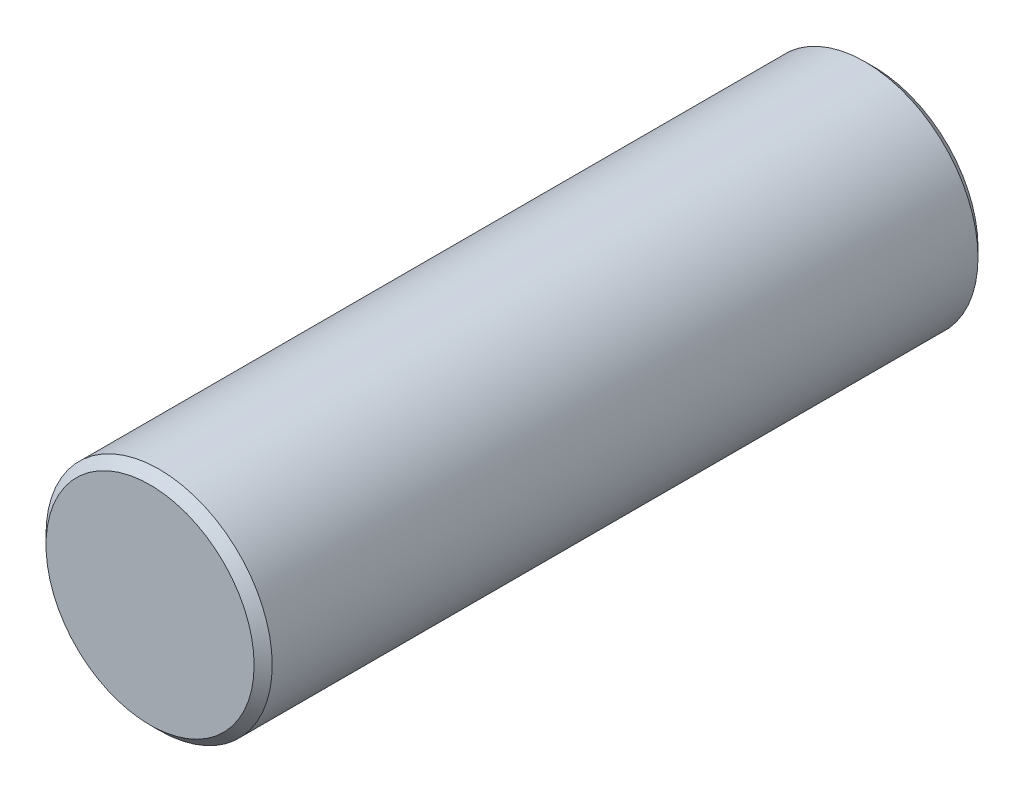
ISO-10303-21;
HEADER;
FILE_DESCRIPTION(('STEP AP214'),'2;1');
FILE_NAME('part.step','',(''),(''),'','','');
FILE_SCHEMA(('AUTOMOTIVE_DESIGN { 1 0 10303 214 1 1 1 1 }'));
ENDSEC;
DATA;
#1=APPLICATION_CONTEXT('core data for automotive mechanical design processes');
#2=APPLICATION_PROTOCOL_DEFINITION('international standard','automotive_design',2000,#1);
#3=PRODUCT_CONTEXT('',#1,'mechanical');
#4=PRODUCT('Part','Part','',(#3));
#5=PRODUCT_RELATED_PRODUCT_CATEGORY('part','',(#4));
#6=PRODUCT_DEFINITION_FORMATION('','',#4);
#7=PRODUCT_DEFINITION_CONTEXT('part definition',#1,'design');
#8=PRODUCT_DEFINITION('design','',#6,#7);
#9=PRODUCT_DEFINITION_SHAPE('','',#8);
#10=(LENGTH_UNIT() NAMED_UNIT(*) SI_UNIT(.MILLI.,.METRE.));
#11=(NAMED_UNIT(*) PLANE_ANGLE_UNIT() SI_UNIT($,.RADIAN.));
#12=(NAMED_UNIT(*) SI_UNIT($,.STERADIAN.) SOLID_ANGLE_UNIT());
#13=UNCERTAINTY_MEASURE_WITH_UNIT(LENGTH_MEASURE(1.E-05),#10,'distance_accuracy_value','');
#14=(GEOMETRIC_REPRESENTATION_CONTEXT(3) GLOBAL_UNCERTAINTY_ASSIGNED_CONTEXT((#13)) GLOBAL_UNIT_ASSIGNED_CONTEXT((#10,
#11,#12)) REPRESENTATION_CONTEXT('',''));
#15=CARTESIAN_POINT('',(0.,0.,0.));
#16=DIRECTION('',(0.,0.,1.));
#17=DIRECTION('',(1.,0.,0.));
#18=AXIS2_PLACEMENT_3D('',#15,#16,#17);
#19=CARTESIAN_POINT('',(0.,0.,16.));
#20=DIRECTION('',(0.,0.,-1.));
#21=DIRECTION('',(-1.,0.,0.));
#22=AXIS2_PLACEMENT_3D('',#19,#20,#21);
#23=CYLINDRICAL_SURFACE('',#22,2.5);
#24=CARTESIAN_POINT('',(0.,0.,0.199999999999999));
#25=DIRECTION('',(0.,0.,1.));
#26=DIRECTION('',(1.,0.,0.));
#27=AXIS2_PLACEMENT_3D('',#24,#25,#26);
#28=CIRCLE('',#27,2.5);
#29=CARTESIAN_POINT('',(2.5,0.,0.199999999999999));
#30=VERTEX_POINT('',#29);
#31=EDGE_CURVE('E53',#30,#30,#28,.T.);
#32=ORIENTED_EDGE('',*,*,#31,.T.);
#33=EDGE_LOOP('',(#32));
#34=FACE_BOUND('',#33,.T.);
#35=CARTESIAN_POINT('',(0.,0.,15.8));
#36=DIRECTION('',(0.,0.,1.));
#37=DIRECTION('',(1.,0.,0.));
#38=AXIS2_PLACEMENT_3D('',#35,#36,#37);
#39=CIRCLE('',#38,2.5);
#40=CARTESIAN_POINT('',(2.5,0.,15.8));
#41=VERTEX_POINT('',#40);
#42=EDGE_CURVE('E58',#41,#41,#39,.F.);
#43=ORIENTED_EDGE('',*,*,#42,.T.);
#44=EDGE_LOOP('',(#43));
#45=FACE_BOUND('',#44,.T.);
#46=ADVANCED_FACE('F39',(#34,#45),#23,.T.);
#47=CARTESIAN_POINT('',(0.,0.,16.));
#48=DIRECTION('',(0.,0.,1.));
#49=DIRECTION('',(1.,0.,0.));
#50=AXIS2_PLACEMENT_3D('',#47,#48,#49);
#51=PLANE('',#50);
#52=CARTESIAN_POINT('',(0.,0.,16.));
#53=DIRECTION('',(0.,0.,1.));
#54=DIRECTION('',(1.,0.,0.));
#55=AXIS2_PLACEMENT_3D('',#52,#53,#54);
#56=CIRCLE('',#55,2.30000000000001);
#57=CARTESIAN_POINT('',(2.30000000000001,0.,16.));
#58=VERTEX_POINT('',#57);
#59=EDGE_CURVE('E10',#58,#58,#56,.T.);
#60=ORIENTED_EDGE('',*,*,#59,.T.);
#61=EDGE_LOOP('',(#60));
#62=FACE_BOUND('',#61,.T.);
#63=ADVANCED_FACE('F75',(#62),#51,.T.);
#64=CARTESIAN_POINT('',(0.,0.,0.));
#65=DIRECTION('',(0.,0.,1.));
#66=DIRECTION('',(1.,0.,0.));
#67=AXIS2_PLACEMENT_3D('',#64,#65,#66);
#68=PLANE('',#67);
#69=CARTESIAN_POINT('',(0.,0.,0.));
#70=DIRECTION('',(0.,0.,1.));
#71=DIRECTION('',(1.,0.,0.));
#72=AXIS2_PLACEMENT_3D('',#69,#70,#71);
#73=CIRCLE('',#72,2.3);
#74=CARTESIAN_POINT('',(2.3,0.,0.));
#75=VERTEX_POINT('',#74);
#76=EDGE_CURVE('E48',#75,#75,#73,.F.);
#77=ORIENTED_EDGE('',*,*,#76,.T.);
#78=EDGE_LOOP('',(#77));
#79=FACE_BOUND('',#78,.T.);
#80=ADVANCED_FACE('F72',(#79),#68,.F.);
#81=CARTESIAN_POINT('',(0.,0.,0.199999999999999));
#82=DIRECTION('',(0.,0.,1.));
#83=DIRECTION('',(1.,0.,0.));
#84=AXIS2_PLACEMENT_3D('',#81,#82,#83);
#85=CONICAL_SURFACE('',#84,2.5,0.78539816339745);
#86=ORIENTED_EDGE('',*,*,#76,.F.);
#87=EDGE_LOOP('',(#86));
#88=FACE_BOUND('',#87,.T.);
#89=ORIENTED_EDGE('',*,*,#31,.F.);
#90=EDGE_LOOP('',(#89));
#91=FACE_BOUND('',#90,.T.);
#92=ADVANCED_FACE('F68',(#88,#91),#85,.T.);
#93=CARTESIAN_POINT('',(0.,0.,16.));
#94=DIRECTION('',(0.,0.,-1.));
#95=DIRECTION('',(-1.,0.,0.));
#96=AXIS2_PLACEMENT_3D('',#93,#94,#95);
#97=CONICAL_SURFACE('',#96,2.30000000000001,0.785398163397446);
#98=ORIENTED_EDGE('',*,*,#42,.F.);
#99=EDGE_LOOP('',(#98));
#100=FACE_BOUND('',#99,.T.);
#101=ORIENTED_EDGE('',*,*,#59,.F.);
#102=EDGE_LOOP('',(#101));
#103=FACE_BOUND('',#102,.T.);
#104=ADVANCED_FACE('F42',(#100,#103),#97,.T.);
#105=CLOSED_SHELL('',(#46,#63,#80,#92,#104));
#106=MANIFOLD_SOLID_BREP('B2',#105);
#107=ADVANCED_BREP_SHAPE_REPRESENTATION('',(#18,#106),#14);
#108=SHAPE_DEFINITION_REPRESENTATION(#9,#107);
ENDSEC;
END-ISO-10303-21;
